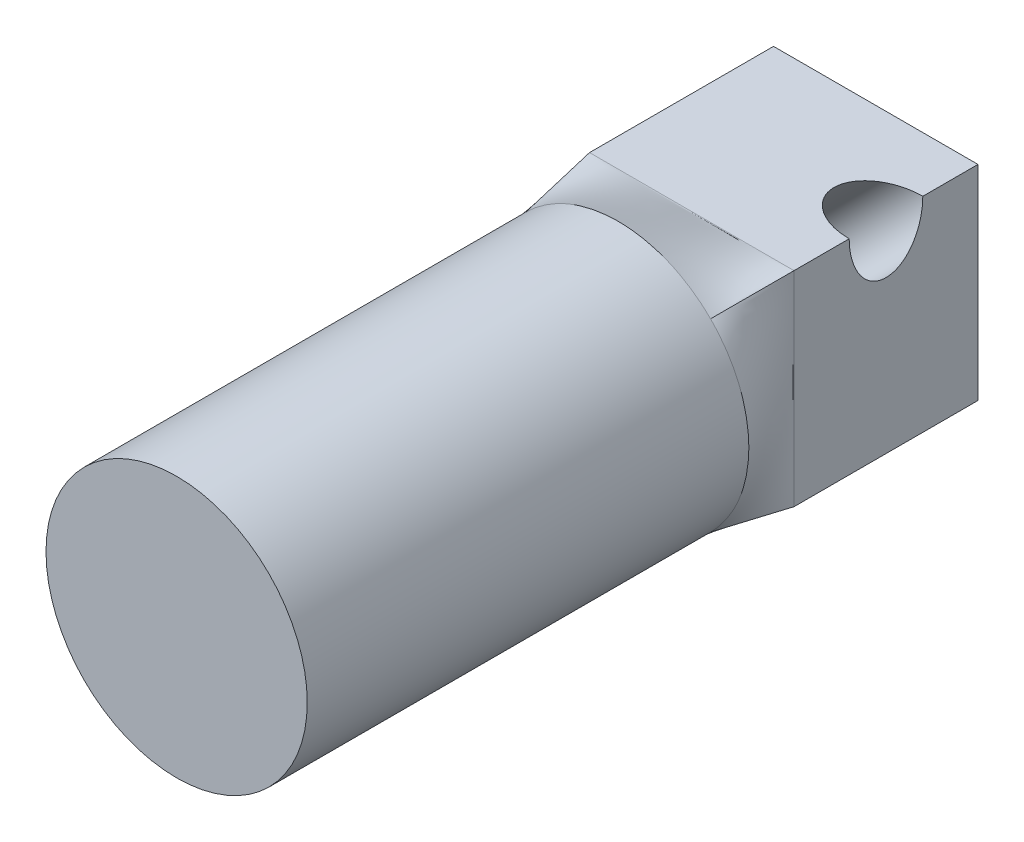
ISO-10303-21;
HEADER;
FILE_DESCRIPTION(('STEP AP214'),'2;1');
FILE_NAME('part.step','',(''),(''),'','','');
FILE_SCHEMA(('AUTOMOTIVE_DESIGN { 1 0 10303 214 1 1 1 1 }'));
ENDSEC;
DATA;
#1=APPLICATION_CONTEXT('core data for automotive mechanical design processes');
#2=APPLICATION_PROTOCOL_DEFINITION('international standard','automotive_design',2000,#1);
#3=PRODUCT_CONTEXT('',#1,'mechanical');
#4=PRODUCT('Part','Part','',(#3));
#5=PRODUCT_RELATED_PRODUCT_CATEGORY('part','',(#4));
#6=PRODUCT_DEFINITION_FORMATION('','',#4);
#7=PRODUCT_DEFINITION_CONTEXT('part definition',#1,'design');
#8=PRODUCT_DEFINITION('design','',#6,#7);
#9=PRODUCT_DEFINITION_SHAPE('','',#8);
#10=(LENGTH_UNIT() NAMED_UNIT(*) SI_UNIT(.MILLI.,.METRE.));
#11=(NAMED_UNIT(*) PLANE_ANGLE_UNIT() SI_UNIT($,.RADIAN.));
#12=(NAMED_UNIT(*) SI_UNIT($,.STERADIAN.) SOLID_ANGLE_UNIT());
#13=UNCERTAINTY_MEASURE_WITH_UNIT(LENGTH_MEASURE(1.E-05),#10,'distance_accuracy_value','');
#14=(GEOMETRIC_REPRESENTATION_CONTEXT(3) GLOBAL_UNCERTAINTY_ASSIGNED_CONTEXT((#13)) GLOBAL_UNIT_ASSIGNED_CONTEXT((#10,
#11,#12)) REPRESENTATION_CONTEXT('',''));
#15=CARTESIAN_POINT('',(0.,0.,0.));
#16=DIRECTION('',(0.,0.,1.));
#17=DIRECTION('',(1.,0.,0.));
#18=AXIS2_PLACEMENT_3D('',#15,#16,#17);
#19=CARTESIAN_POINT('',(-2.77842712474619,2.77842712474619,0.));
#20=CARTESIAN_POINT('',(-2.51022907321224,2.51022907321224,2.));
#21=CARTESIAN_POINT('',(-2.77842712474619,2.31535593728849,0.));
#22=CARTESIAN_POINT('',(-2.80606240654558,2.21439573987891,2.));
#23=CARTESIAN_POINT('',(-2.77842712474619,1.85228474983079,0.));
#24=CARTESIAN_POINT('',(-3.07131301654712,1.84131202062623,2.));
#25=CARTESIAN_POINT('',(-2.77842712474619,0.926142374915396,0.));
#26=CARTESIAN_POINT('',(-3.4446543172476,0.978647146617172,2.));
#27=CARTESIAN_POINT('',(-2.77842712474619,0.463071187457698,0.));
#28=CARTESIAN_POINT('',(-3.55,0.49015271547483,2.));
#29=CARTESIAN_POINT('',(-2.77842712474619,-0.463071187457699,0.));
#30=CARTESIAN_POINT('',(-3.55,-0.490152715474828,2.));
#31=CARTESIAN_POINT('',(-2.77842712474619,-0.926142374915397,0.));
#32=CARTESIAN_POINT('',(-3.4446543172476,-0.97864714661717,2.));
#33=CARTESIAN_POINT('',(-2.77842712474619,-1.85228474983079,0.));
#34=CARTESIAN_POINT('',(-3.07131301654712,-1.84131202062623,2.));
#35=CARTESIAN_POINT('',(-2.77842712474619,-2.31535593728849,0.));
#36=CARTESIAN_POINT('',(-2.80606240654558,-2.21439573987891,2.));
#37=CARTESIAN_POINT('',(-2.77842712474619,-2.77842712474619,0.));
#38=CARTESIAN_POINT('',(-2.51022907321224,-2.51022907321224,2.));
#39=B_SPLINE_SURFACE_WITH_KNOTS('',3,1,((#19,#20),(#21,#22),(#23,#24),(#25,#26),(#27,#28),(#29,
#30),(#31,#32),(#33,#34),(#35,#36),(#37,#38)),.UNSPECIFIED.,.F.,.F.,.F.,(4,2,2,2,4),(2,2),(0.,
0.25,0.5,0.75,1.),(0.,1.),.UNSPECIFIED.);
#40=DIRECTION('',(0.,-1.,0.));
#41=VECTOR('',#40,1.);
#42=CARTESIAN_POINT('',(-2.77842712474619,-2.77842712474619,0.));
#43=LINE('',#42,#41);
#44=CARTESIAN_POINT('',(-2.77842712474619,2.77842712474619,0.));
#45=VERTEX_POINT('',#44);
#46=CARTESIAN_POINT('',(-2.77842712474619,-2.77842712474619,0.));
#47=VERTEX_POINT('',#46);
#48=EDGE_CURVE('E270',#45,#47,#43,.T.);
#49=DIRECTION('',(0.131750739264987,0.131750739264988,0.982488414896714));
#50=VECTOR('',#49,1.);
#51=CARTESIAN_POINT('',(-2.64432809897922,-2.64432809897922,1.));
#52=LINE('',#51,#50);
#53=CARTESIAN_POINT('',(-2.51022907321224,-2.51022907321224,2.));
#54=VERTEX_POINT('',#53);
#55=EDGE_CURVE('E209',#47,#54,#52,.T.);
#56=CARTESIAN_POINT('',(0.,0.,2.));
#57=DIRECTION('',(0.,0.,1.));
#58=DIRECTION('',(1.,0.,0.));
#59=AXIS2_PLACEMENT_3D('',#56,#57,#58);
#60=CIRCLE('',#59,3.55);
#61=CARTESIAN_POINT('',(-2.51022907321224,2.51022907321224,2.));
#62=VERTEX_POINT('',#61);
#63=EDGE_CURVE('E175',#62,#54,#60,.T.);
#64=DIRECTION('',(-0.131750739264988,0.131750739264986,-0.982488414896715));
#65=VECTOR('',#64,1.);
#66=CARTESIAN_POINT('',(-2.64432809897922,2.64432809897922,1.));
#67=LINE('',#66,#65);
#68=EDGE_CURVE('E228',#62,#45,#67,.T.);
#69=ORIENTED_EDGE('',*,*,#48,.T.);
#70=ORIENTED_EDGE('',*,*,#55,.T.);
#71=ORIENTED_EDGE('',*,*,#63,.F.);
#72=ORIENTED_EDGE('',*,*,#68,.T.);
#73=EDGE_LOOP('',(#69,#70,#71,#72));
#74=FACE_BOUND('',#73,.T.);
#75=ADVANCED_FACE('F73',(#74),#39,.T.);
#76=CARTESIAN_POINT('',(-2.77842712474619,-2.77842712474619,0.));
#77=CARTESIAN_POINT('',(-2.51022907321224,-2.51022907321224,2.));
#78=CARTESIAN_POINT('',(-2.31535593728849,-2.77842712474619,0.));
#79=CARTESIAN_POINT('',(-2.21439573987891,-2.80606240654558,2.));
#80=CARTESIAN_POINT('',(-1.85228474983079,-2.77842712474619,0.));
#81=CARTESIAN_POINT('',(-1.84131202062623,-3.07131301654712,2.));
#82=CARTESIAN_POINT('',(-0.926142374915397,-2.77842712474619,0.));
#83=CARTESIAN_POINT('',(-0.978647146617173,-3.4446543172476,2.));
#84=CARTESIAN_POINT('',(-0.463071187457699,-2.77842712474619,0.));
#85=CARTESIAN_POINT('',(-0.490152715474831,-3.55,2.));
#86=CARTESIAN_POINT('',(0.463071187457698,-2.77842712474619,0.));
#87=CARTESIAN_POINT('',(0.490152715474827,-3.55,2.));
#88=CARTESIAN_POINT('',(0.926142374915396,-2.77842712474619,0.));
#89=CARTESIAN_POINT('',(0.97864714661717,-3.4446543172476,2.));
#90=CARTESIAN_POINT('',(1.85228474983079,-2.77842712474619,0.));
#91=CARTESIAN_POINT('',(1.84131202062623,-3.07131301654712,2.));
#92=CARTESIAN_POINT('',(2.31535593728849,-2.77842712474619,0.));
#93=CARTESIAN_POINT('',(2.21439573987891,-2.80606240654558,2.));
#94=CARTESIAN_POINT('',(2.77842712474619,-2.77842712474619,0.));
#95=CARTESIAN_POINT('',(2.51022907321224,-2.51022907321224,2.));
#96=B_SPLINE_SURFACE_WITH_KNOTS('',3,1,((#76,#77),(#78,#79),(#80,#81),(#82,#83),(#84,#85),(#86,
#87),(#88,#89),(#90,#91),(#92,#93),(#94,#95)),.UNSPECIFIED.,.F.,.F.,.F.,(4,2,2,2,4),(2,2),(0.,
0.25,0.5,0.75,1.),(0.,1.),.UNSPECIFIED.);
#97=DIRECTION('',(1.,0.,0.));
#98=VECTOR('',#97,1.);
#99=CARTESIAN_POINT('',(2.77842712474619,-2.77842712474619,0.));
#100=LINE('',#99,#98);
#101=CARTESIAN_POINT('',(2.77842712474619,-2.77842712474619,0.));
#102=VERTEX_POINT('',#101);
#103=EDGE_CURVE('E170',#47,#102,#100,.T.);
#104=DIRECTION('',(-0.131750739264988,0.131750739264987,0.982488414896714));
#105=VECTOR('',#104,1.);
#106=CARTESIAN_POINT('',(2.64432809897922,-2.64432809897922,1.));
#107=LINE('',#106,#105);
#108=CARTESIAN_POINT('',(2.51022907321224,-2.51022907321224,2.));
#109=VERTEX_POINT('',#108);
#110=EDGE_CURVE('E203',#102,#109,#107,.T.);
#111=EDGE_CURVE('E179',#54,#109,#60,.T.);
#112=ORIENTED_EDGE('',*,*,#103,.T.);
#113=ORIENTED_EDGE('',*,*,#110,.T.);
#114=ORIENTED_EDGE('',*,*,#111,.F.);
#115=ORIENTED_EDGE('',*,*,#55,.F.);
#116=EDGE_LOOP('',(#112,#113,#114,#115));
#117=FACE_BOUND('',#116,.T.);
#118=ADVANCED_FACE('F240',(#117),#96,.T.);
#119=CARTESIAN_POINT('',(2.77842712474619,2.77842712474619,0.));
#120=CARTESIAN_POINT('',(2.51022907321224,2.51022907321224,2.));
#121=CARTESIAN_POINT('',(2.31535593728849,2.77842712474619,0.));
#122=CARTESIAN_POINT('',(2.21439573987891,2.80606240654558,2.));
#123=CARTESIAN_POINT('',(1.8522847498308,2.77842712474619,0.));
#124=CARTESIAN_POINT('',(1.84131202062623,3.07131301654712,2.));
#125=CARTESIAN_POINT('',(0.926142374915403,2.77842712474619,0.));
#126=CARTESIAN_POINT('',(0.978647146617172,3.4446543172476,2.));
#127=CARTESIAN_POINT('',(0.463071187457706,2.77842712474619,0.));
#128=CARTESIAN_POINT('',(0.49015271547483,3.55,2.));
#129=CARTESIAN_POINT('',(-0.463071187457691,2.77842712474619,0.));
#130=CARTESIAN_POINT('',(-0.490152715474829,3.55,2.));
#131=CARTESIAN_POINT('',(-0.92614237491539,2.77842712474619,0.));
#132=CARTESIAN_POINT('',(-0.978647146617171,3.4446543172476,2.));
#133=CARTESIAN_POINT('',(-1.85228474983079,2.77842712474619,0.));
#134=CARTESIAN_POINT('',(-1.84131202062623,3.07131301654712,2.));
#135=CARTESIAN_POINT('',(-2.31535593728849,2.77842712474619,0.));
#136=CARTESIAN_POINT('',(-2.21439573987891,2.80606240654558,2.));
#137=CARTESIAN_POINT('',(-2.77842712474619,2.77842712474619,0.));
#138=CARTESIAN_POINT('',(-2.51022907321224,2.51022907321224,2.));
#139=B_SPLINE_SURFACE_WITH_KNOTS('',3,1,((#119,#120),(#121,#122),(#123,#124),(#125,#126),(#127,
#128),(#129,#130),(#131,#132),(#133,#134),(#135,#136),(#137,#138)),.UNSPECIFIED.,.F.,.F.,.F.,(4,
2,2,2,4),(2,2),(0.,0.25,0.5,0.75,1.),(0.,1.),.UNSPECIFIED.);
#140=DIRECTION('',(-1.,0.,0.));
#141=VECTOR('',#140,1.);
#142=CARTESIAN_POINT('',(2.77842712474619,2.77842712474619,0.));
#143=LINE('',#142,#141);
#144=CARTESIAN_POINT('',(2.77842712474619,2.77842712474619,0.));
#145=VERTEX_POINT('',#144);
#146=EDGE_CURVE('E223',#145,#45,#143,.T.);
#147=CARTESIAN_POINT('',(2.51022907321224,2.51022907321224,2.));
#148=VERTEX_POINT('',#147);
#149=EDGE_CURVE('E86',#148,#62,#60,.T.);
#150=DIRECTION('',(-0.131750739264987,-0.131750739264986,0.982488414896715));
#151=VECTOR('',#150,1.);
#152=CARTESIAN_POINT('',(2.64432809897922,2.64432809897921,1.));
#153=LINE('',#152,#151);
#154=EDGE_CURVE('E199',#145,#148,#153,.T.);
#155=ORIENTED_EDGE('',*,*,#146,.T.);
#156=ORIENTED_EDGE('',*,*,#68,.F.);
#157=ORIENTED_EDGE('',*,*,#149,.F.);
#158=ORIENTED_EDGE('',*,*,#154,.F.);
#159=EDGE_LOOP('',(#155,#156,#157,#158));
#160=FACE_BOUND('',#159,.T.);
#161=ADVANCED_FACE('F230',(#160),#139,.T.);
#162=CARTESIAN_POINT('',(2.77842712474619,-2.77842712474619,0.));
#163=CARTESIAN_POINT('',(2.51022907321224,-2.51022907321224,2.));
#164=CARTESIAN_POINT('',(2.77842712474619,-2.31535593728849,0.));
#165=CARTESIAN_POINT('',(2.80606240654558,-2.21439573987891,2.));
#166=CARTESIAN_POINT('',(2.77842712474619,-1.85228474983079,0.));
#167=CARTESIAN_POINT('',(3.07131301654712,-1.84131202062623,2.));
#168=CARTESIAN_POINT('',(2.77842712474619,-0.926142374915392,0.));
#169=CARTESIAN_POINT('',(3.4446543172476,-0.978647146617172,2.));
#170=CARTESIAN_POINT('',(2.77842712474619,-0.463071187457693,0.));
#171=CARTESIAN_POINT('',(3.55,-0.49015271547483,2.));
#172=CARTESIAN_POINT('',(2.77842712474619,0.463071187457703,0.));
#173=CARTESIAN_POINT('',(3.55,0.490152715474829,2.));
#174=CARTESIAN_POINT('',(2.77842712474619,0.926142374915401,0.));
#175=CARTESIAN_POINT('',(3.4446543172476,0.978647146617171,2.));
#176=CARTESIAN_POINT('',(2.77842712474619,1.85228474983079,0.));
#177=CARTESIAN_POINT('',(3.07131301654712,1.84131202062623,2.));
#178=CARTESIAN_POINT('',(2.77842712474619,2.31535593728849,0.));
#179=CARTESIAN_POINT('',(2.80606240654558,2.21439573987891,2.));
#180=CARTESIAN_POINT('',(2.77842712474619,2.77842712474619,0.));
#181=CARTESIAN_POINT('',(2.51022907321224,2.51022907321224,2.));
#182=B_SPLINE_SURFACE_WITH_KNOTS('',3,1,((#162,#163),(#164,#165),(#166,#167),(#168,#169),(#170,
#171),(#172,#173),(#174,#175),(#176,#177),(#178,#179),(#180,#181)),.UNSPECIFIED.,.F.,.F.,.F.,(4,
2,2,2,4),(2,2),(0.,0.25,0.5,0.75,1.),(0.,1.),.UNSPECIFIED.);
#183=DIRECTION('',(0.,1.,0.));
#184=VECTOR('',#183,1.);
#185=CARTESIAN_POINT('',(2.77842712474619,-2.77842712474619,0.));
#186=LINE('',#185,#184);
#187=EDGE_CURVE('E303',#102,#145,#186,.T.);
#188=EDGE_CURVE('E192',#109,#148,#60,.T.);
#189=ORIENTED_EDGE('',*,*,#187,.T.);
#190=ORIENTED_EDGE('',*,*,#154,.T.);
#191=ORIENTED_EDGE('',*,*,#188,.F.);
#192=ORIENTED_EDGE('',*,*,#110,.F.);
#193=EDGE_LOOP('',(#189,#190,#191,#192));
#194=FACE_BOUND('',#193,.T.);
#195=ADVANCED_FACE('F75',(#194),#182,.T.);
#196=CARTESIAN_POINT('',(-2.77842712474619,2.77842712474619,-5.));
#197=DIRECTION('',(0.,-1.,0.));
#198=DIRECTION('',(1.,0.,0.));
#199=AXIS2_PLACEMENT_3D('',#196,#197,#198);
#200=PLANE('',#199);
#201=DIRECTION('',(0.,0.,1.));
#202=VECTOR('',#201,1.);
#203=CARTESIAN_POINT('',(2.77842712474619,2.77842712474619,-5.));
#204=LINE('',#203,#202);
#205=CARTESIAN_POINT('',(2.77842712474619,2.77842712474619,-1.5));
#206=VERTEX_POINT('',#205);
#207=EDGE_CURVE('E80',#206,#145,#204,.T.);
#208=ORIENTED_EDGE('',*,*,#207,.F.);
#209=CARTESIAN_POINT('',(2.77842712474619,2.77842712474619,-2.5));
#210=DIRECTION('',(0.,-1.,0.));
#211=DIRECTION('',(1.,0.,0.));
#212=AXIS2_PLACEMENT_3D('',#209,#210,#211);
#213=ELLIPSE('',#212,1.4142135623731,1.);
#214=CARTESIAN_POINT('',(2.77842712474619,2.77842712474619,-3.5));
#215=VERTEX_POINT('',#214);
#216=EDGE_CURVE('E92',#206,#215,#213,.T.);
#217=ORIENTED_EDGE('',*,*,#216,.T.);
#218=CARTESIAN_POINT('',(2.77842712474619,2.77842712474619,-5.));
#219=VERTEX_POINT('',#218);
#220=EDGE_CURVE('E307',#219,#215,#204,.T.);
#221=ORIENTED_EDGE('',*,*,#220,.F.);
#222=DIRECTION('',(1.,0.,0.));
#223=VECTOR('',#222,1.);
#224=CARTESIAN_POINT('',(-2.77842712474619,2.77842712474619,-5.));
#225=LINE('',#224,#223);
#226=CARTESIAN_POINT('',(-2.77842712474619,2.77842712474619,-5.));
#227=VERTEX_POINT('',#226);
#228=EDGE_CURVE('E282',#227,#219,#225,.T.);
#229=ORIENTED_EDGE('',*,*,#228,.F.);
#230=DIRECTION('',(0.,0.,1.));
#231=VECTOR('',#230,1.);
#232=CARTESIAN_POINT('',(-2.77842712474619,2.77842712474619,-5.));
#233=LINE('',#232,#231);
#234=EDGE_CURVE('E160',#227,#45,#233,.T.);
#235=ORIENTED_EDGE('',*,*,#234,.T.);
#236=ORIENTED_EDGE('',*,*,#146,.F.);
#237=EDGE_LOOP('',(#208,#217,#221,#229,#235,#236));
#238=FACE_BOUND('',#237,.T.);
#239=ADVANCED_FACE('F337',(#238),#200,.F.);
#240=CARTESIAN_POINT('',(2.77842712474619,2.77842712474619,-5.));
#241=DIRECTION('',(-1.,0.,0.));
#242=DIRECTION('',(0.,0.,1.));
#243=AXIS2_PLACEMENT_3D('',#240,#241,#242);
#244=PLANE('',#243);
#245=ORIENTED_EDGE('',*,*,#220,.T.);
#246=CARTESIAN_POINT('',(2.77842712474619,2.77842712474619,-2.5));
#247=DIRECTION('',(-1.,0.,0.));
#248=DIRECTION('',(0.,1.,0.));
#249=AXIS2_PLACEMENT_3D('',#246,#247,#248);
#250=ELLIPSE('',#249,1.41421356237309,1.);
#251=EDGE_CURVE('E151',#215,#206,#250,.T.);
#252=ORIENTED_EDGE('',*,*,#251,.T.);
#253=ORIENTED_EDGE('',*,*,#207,.T.);
#254=ORIENTED_EDGE('',*,*,#187,.F.);
#255=DIRECTION('',(0.,0.,1.));
#256=VECTOR('',#255,1.);
#257=CARTESIAN_POINT('',(2.77842712474619,-2.77842712474619,-5.));
#258=LINE('',#257,#256);
#259=CARTESIAN_POINT('',(2.77842712474619,-2.77842712474619,-5.));
#260=VERTEX_POINT('',#259);
#261=EDGE_CURVE('E156',#260,#102,#258,.T.);
#262=ORIENTED_EDGE('',*,*,#261,.F.);
#263=DIRECTION('',(0.,-1.,0.));
#264=VECTOR('',#263,1.);
#265=CARTESIAN_POINT('',(2.77842712474619,2.77842712474619,-5.));
#266=LINE('',#265,#264);
#267=EDGE_CURVE('E285',#219,#260,#266,.T.);
#268=ORIENTED_EDGE('',*,*,#267,.F.);
#269=EDGE_LOOP('',(#245,#252,#253,#254,#262,#268));
#270=FACE_BOUND('',#269,.T.);
#271=ADVANCED_FACE('F328',(#270),#244,.F.);
#272=CARTESIAN_POINT('',(2.77842712474619,-2.77842712474619,-5.));
#273=DIRECTION('',(0.,1.,0.));
#274=DIRECTION('',(0.,0.,1.));
#275=AXIS2_PLACEMENT_3D('',#272,#273,#274);
#276=PLANE('',#275);
#277=DIRECTION('',(0.,0.,1.));
#278=VECTOR('',#277,1.);
#279=CARTESIAN_POINT('',(-2.77842712474619,-2.77842712474619,-5.));
#280=LINE('',#279,#278);
#281=CARTESIAN_POINT('',(-2.77842712474619,-2.77842712474619,-1.5));
#282=VERTEX_POINT('',#281);
#283=EDGE_CURVE('E150',#282,#47,#280,.T.);
#284=ORIENTED_EDGE('',*,*,#283,.F.);
#285=CARTESIAN_POINT('',(-2.77842712474621,-2.77842712474619,-2.5));
#286=DIRECTION('',(0.,1.,0.));
#287=DIRECTION('',(1.,0.,0.));
#288=AXIS2_PLACEMENT_3D('',#285,#286,#287);
#289=ELLIPSE('',#288,1.4142135623731,1.);
#290=CARTESIAN_POINT('',(-2.77842712474619,-2.77842712474619,-3.5));
#291=VERTEX_POINT('',#290);
#292=EDGE_CURVE('E99',#282,#291,#289,.T.);
#293=ORIENTED_EDGE('',*,*,#292,.T.);
#294=CARTESIAN_POINT('',(-2.77842712474619,-2.77842712474619,-5.));
#295=VERTEX_POINT('',#294);
#296=EDGE_CURVE('E147',#295,#291,#280,.T.);
#297=ORIENTED_EDGE('',*,*,#296,.F.);
#298=DIRECTION('',(-1.,0.,0.));
#299=VECTOR('',#298,1.);
#300=CARTESIAN_POINT('',(2.77842712474619,-2.77842712474619,-5.));
#301=LINE('',#300,#299);
#302=EDGE_CURVE('E288',#260,#295,#301,.T.);
#303=ORIENTED_EDGE('',*,*,#302,.F.);
#304=ORIENTED_EDGE('',*,*,#261,.T.);
#305=ORIENTED_EDGE('',*,*,#103,.F.);
#306=EDGE_LOOP('',(#284,#293,#297,#303,#304,#305));
#307=FACE_BOUND('',#306,.T.);
#308=ADVANCED_FACE('F145',(#307),#276,.F.);
#309=CARTESIAN_POINT('',(-2.77842712474619,-2.77842712474619,-5.));
#310=DIRECTION('',(1.,0.,0.));
#311=DIRECTION('',(0.,1.,0.));
#312=AXIS2_PLACEMENT_3D('',#309,#310,#311);
#313=PLANE('',#312);
#314=ORIENTED_EDGE('',*,*,#296,.T.);
#315=CARTESIAN_POINT('',(-2.77842712474619,-2.77842712474617,-2.5));
#316=DIRECTION('',(1.,0.,0.));
#317=DIRECTION('',(0.,1.,0.));
#318=AXIS2_PLACEMENT_3D('',#315,#316,#317);
#319=ELLIPSE('',#318,1.41421356237309,1.);
#320=EDGE_CURVE('E12',#291,#282,#319,.T.);
#321=ORIENTED_EDGE('',*,*,#320,.T.);
#322=ORIENTED_EDGE('',*,*,#283,.T.);
#323=ORIENTED_EDGE('',*,*,#48,.F.);
#324=ORIENTED_EDGE('',*,*,#234,.F.);
#325=DIRECTION('',(0.,1.,0.));
#326=VECTOR('',#325,1.);
#327=CARTESIAN_POINT('',(-2.77842712474619,-2.77842712474619,-5.));
#328=LINE('',#327,#326);
#329=EDGE_CURVE('E155',#295,#227,#328,.T.);
#330=ORIENTED_EDGE('',*,*,#329,.F.);
#331=EDGE_LOOP('',(#314,#321,#322,#323,#324,#330));
#332=FACE_BOUND('',#331,.T.);
#333=ADVANCED_FACE('F153',(#332),#313,.F.);
#334=CARTESIAN_POINT('',(0.,0.,-5.));
#335=DIRECTION('',(0.,0.,-1.));
#336=DIRECTION('',(-1.,0.,0.));
#337=AXIS2_PLACEMENT_3D('',#334,#335,#336);
#338=PLANE('',#337);
#339=ORIENTED_EDGE('',*,*,#228,.T.);
#340=ORIENTED_EDGE('',*,*,#267,.T.);
#341=ORIENTED_EDGE('',*,*,#302,.T.);
#342=ORIENTED_EDGE('',*,*,#329,.T.);
#343=EDGE_LOOP('',(#339,#340,#341,#342));
#344=FACE_BOUND('',#343,.T.);
#345=ADVANCED_FACE('F360',(#344),#338,.T.);
#346=CARTESIAN_POINT('',(0.,0.,14.));
#347=DIRECTION('',(0.,0.,-1.));
#348=DIRECTION('',(-1.,0.,0.));
#349=AXIS2_PLACEMENT_3D('',#346,#347,#348);
#350=CYLINDRICAL_SURFACE('',#349,3.55);
#351=ORIENTED_EDGE('',*,*,#149,.T.);
#352=ORIENTED_EDGE('',*,*,#63,.T.);
#353=ORIENTED_EDGE('',*,*,#111,.T.);
#354=ORIENTED_EDGE('',*,*,#188,.T.);
#355=EDGE_LOOP('',(#351,#352,#353,#354));
#356=FACE_BOUND('',#355,.T.);
#357=CARTESIAN_POINT('',(0.,0.,14.));
#358=DIRECTION('',(0.,0.,1.));
#359=DIRECTION('',(1.,0.,0.));
#360=AXIS2_PLACEMENT_3D('',#357,#358,#359);
#361=CIRCLE('',#360,3.55);
#362=CARTESIAN_POINT('',(3.55,0.,14.));
#363=VERTEX_POINT('',#362);
#364=EDGE_CURVE('E286',#363,#363,#361,.T.);
#365=ORIENTED_EDGE('',*,*,#364,.F.);
#366=EDGE_LOOP('',(#365));
#367=FACE_BOUND('',#366,.T.);
#368=ADVANCED_FACE('F274',(#356,#367),#350,.T.);
#369=CARTESIAN_POINT('',(0.,0.,14.));
#370=DIRECTION('',(0.,0.,1.));
#371=DIRECTION('',(1.,0.,0.));
#372=AXIS2_PLACEMENT_3D('',#369,#370,#371);
#373=PLANE('',#372);
#374=ORIENTED_EDGE('',*,*,#364,.T.);
#375=EDGE_LOOP('',(#374));
#376=FACE_BOUND('',#375,.T.);
#377=ADVANCED_FACE('F367',(#376),#373,.T.);
#378=CARTESIAN_POINT('',(-3.53553390593275,-3.53553390593273,-2.5));
#379=DIRECTION('',(0.707106781186549,0.707106781186546,0.));
#380=DIRECTION('',(-0.707106781186546,0.707106781186549,0.));
#381=AXIS2_PLACEMENT_3D('',#378,#379,#380);
#382=CYLINDRICAL_SURFACE('',#381,1.);
#383=ORIENTED_EDGE('',*,*,#320,.F.);
#384=ORIENTED_EDGE('',*,*,#292,.F.);
#385=EDGE_LOOP('',(#383,#384));
#386=FACE_BOUND('',#385,.T.);
#387=ORIENTED_EDGE('',*,*,#251,.F.);
#388=ORIENTED_EDGE('',*,*,#216,.F.);
#389=EDGE_LOOP('',(#387,#388));
#390=FACE_BOUND('',#389,.T.);
#391=ADVANCED_FACE('F139',(#386,#390),#382,.F.);
#392=CLOSED_SHELL('',(#75,#118,#161,#195,#239,#271,#308,#333,#345,#368,#377,#391));
#393=MANIFOLD_SOLID_BREP('B2',#392);
#394=ADVANCED_BREP_SHAPE_REPRESENTATION('',(#18,#393),#14);
#395=SHAPE_DEFINITION_REPRESENTATION(#9,#394);
ENDSEC;
END-ISO-10303-21;
